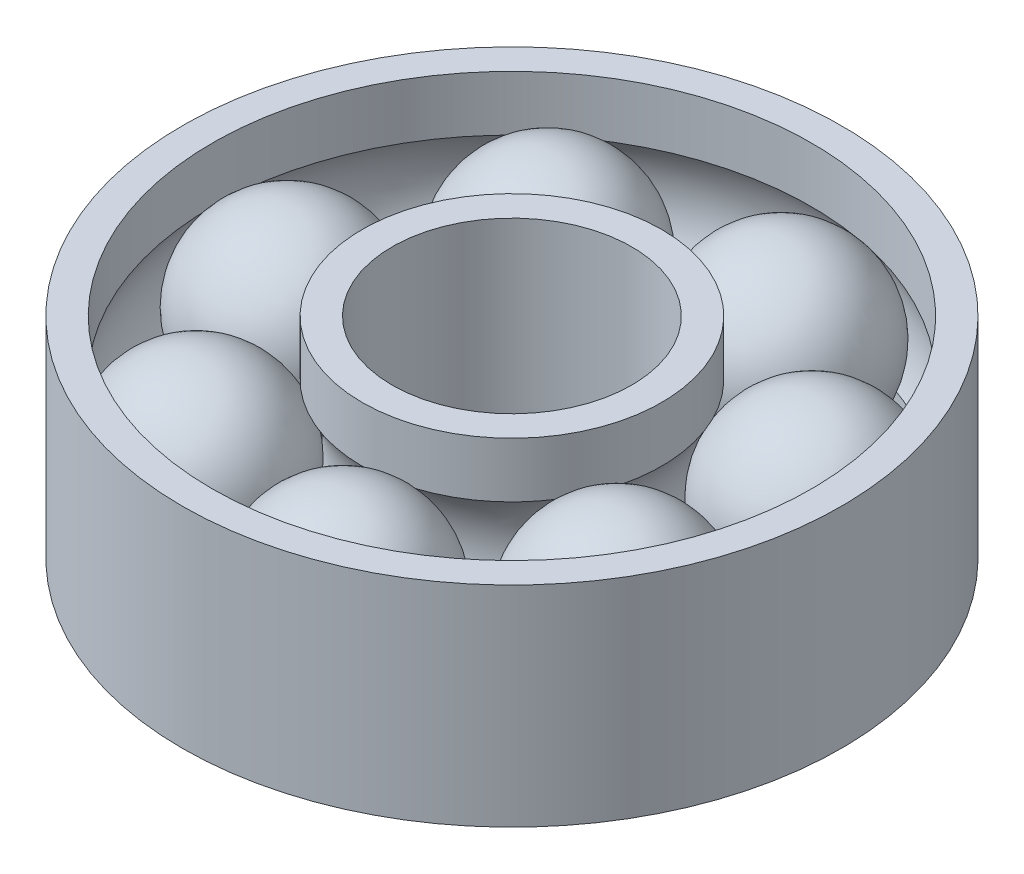
ISO-10303-21;
HEADER;
FILE_DESCRIPTION(('STEP AP214'),'2;1');
FILE_NAME('part.step','',(''),(''),'','','');
FILE_SCHEMA(('AUTOMOTIVE_DESIGN { 1 0 10303 214 1 1 1 1 }'));
ENDSEC;
DATA;
#1=APPLICATION_CONTEXT('core data for automotive mechanical design processes');
#2=APPLICATION_PROTOCOL_DEFINITION('international standard','automotive_design',2000,#1);
#3=PRODUCT_CONTEXT('',#1,'mechanical');
#4=PRODUCT('Part','Part','',(#3));
#5=PRODUCT_RELATED_PRODUCT_CATEGORY('part','',(#4));
#6=PRODUCT_DEFINITION_FORMATION('','',#4);
#7=PRODUCT_DEFINITION_CONTEXT('part definition',#1,'design');
#8=PRODUCT_DEFINITION('design','',#6,#7);
#9=PRODUCT_DEFINITION_SHAPE('','',#8);
#10=(LENGTH_UNIT() NAMED_UNIT(*) SI_UNIT(.MILLI.,.METRE.));
#11=(NAMED_UNIT(*) PLANE_ANGLE_UNIT() SI_UNIT($,.RADIAN.));
#12=(NAMED_UNIT(*) SI_UNIT($,.STERADIAN.) SOLID_ANGLE_UNIT());
#13=UNCERTAINTY_MEASURE_WITH_UNIT(LENGTH_MEASURE(1.E-05),#10,'distance_accuracy_value','');
#14=(GEOMETRIC_REPRESENTATION_CONTEXT(3) GLOBAL_UNCERTAINTY_ASSIGNED_CONTEXT((#13)) GLOBAL_UNIT_ASSIGNED_CONTEXT((#10,
#11,#12)) REPRESENTATION_CONTEXT('',''));
#15=CARTESIAN_POINT('',(0.,0.,0.));
#16=DIRECTION('',(0.,0.,1.));
#17=DIRECTION('',(1.,0.,0.));
#18=AXIS2_PLACEMENT_3D('',#15,#16,#17);
#19=CARTESIAN_POINT('',(-4.67617351394057,1.04291762280334,-5.86373611851017));
#20=DIRECTION('',(0.,1.,0.));
#21=DIRECTION('',(-0.623489801858743,0.,-0.781831482468022));
#22=AXIS2_PLACEMENT_3D('',#19,#20,#21);
#23=SPHERICAL_SURFACE('',#22,3.);
#24=CARTESIAN_POINT('',(-4.67617351394057,4.04291762280334,-5.86373611851016));
#25=VERTEX_POINT('',#24);
#26=VERTEX_LOOP('',#25);
#27=FACE_BOUND('',#26,.T.);
#28=ADVANCED_FACE('F37',(#27),#23,.T.);
#29=CLOSED_SHELL('',(#28));
#30=MANIFOLD_SOLID_BREP('B2',#29);
#31=CARTESIAN_POINT('',(1.66890700467229,1.04291762280334,-7.31195934136369));
#32=DIRECTION('',(0.,1.,0.));
#33=DIRECTION('',(0.222520933956305,0.,-0.974927912181826));
#34=AXIS2_PLACEMENT_3D('',#31,#32,#33);
#35=SPHERICAL_SURFACE('',#34,3.);
#36=CARTESIAN_POINT('',(1.66890700467229,4.04291762280334,-7.31195934136368));
#37=VERTEX_POINT('',#36);
#38=VERTEX_LOOP('',#37);
#39=FACE_BOUND('',#38,.T.);
#40=ADVANCED_FACE('F55',(#39),#35,.T.);
#41=CLOSED_SHELL('',(#40));
#42=MANIFOLD_SOLID_BREP('B6',#41);
#43=CARTESIAN_POINT('',(6.75726650926812,1.04291762280334,-3.25412804338174));
#44=DIRECTION('',(0.,1.,0.));
#45=DIRECTION('',(0.900968867902416,0.,-0.433883739117565));
#46=AXIS2_PLACEMENT_3D('',#43,#44,#45);
#47=SPHERICAL_SURFACE('',#46,3.);
#48=CARTESIAN_POINT('',(6.75726650926811,4.04291762280334,-3.25412804338173));
#49=VERTEX_POINT('',#48);
#50=VERTEX_LOOP('',#49);
#51=FACE_BOUND('',#50,.T.);
#52=ADVANCED_FACE('F73',(#51),#47,.T.);
#53=CLOSED_SHELL('',(#52));
#54=MANIFOLD_SOLID_BREP('B33',#53);
#55=CARTESIAN_POINT('',(6.75726650926816,1.04291762280334,3.25412804338164));
#56=DIRECTION('',(0.,1.,0.));
#57=DIRECTION('',(0.900968867902422,0.,0.433883739117553));
#58=AXIS2_PLACEMENT_3D('',#55,#56,#57);
#59=SPHERICAL_SURFACE('',#58,3.);
#60=CARTESIAN_POINT('',(6.75726650926816,4.04291762280334,3.25412804338164));
#61=VERTEX_POINT('',#60);
#62=VERTEX_LOOP('',#61);
#63=FACE_BOUND('',#62,.T.);
#64=ADVANCED_FACE('F91',(#63),#59,.T.);
#65=CLOSED_SHELL('',(#64));
#66=MANIFOLD_SOLID_BREP('B51',#65);
#67=CARTESIAN_POINT('',(1.66890700467239,1.04291762280334,7.31195934136367));
#68=DIRECTION('',(0.,1.,0.));
#69=DIRECTION('',(0.222520933956318,0.,0.974927912181823));
#70=AXIS2_PLACEMENT_3D('',#67,#68,#69);
#71=SPHERICAL_SURFACE('',#70,3.);
#72=CARTESIAN_POINT('',(1.66890700467238,4.04291762280334,7.31195934136366));
#73=VERTEX_POINT('',#72);
#74=VERTEX_LOOP('',#73);
#75=FACE_BOUND('',#74,.T.);
#76=ADVANCED_FACE('F109',(#75),#71,.T.);
#77=CLOSED_SHELL('',(#76));
#78=MANIFOLD_SOLID_BREP('B69',#77);
#79=CARTESIAN_POINT('',(-4.67617351394049,1.04291762280334,5.86373611851023));
#80=DIRECTION('',(0.,1.,0.));
#81=DIRECTION('',(-0.623489801858732,0.,0.781831482468031));
#82=AXIS2_PLACEMENT_3D('',#79,#80,#81);
#83=SPHERICAL_SURFACE('',#82,3.);
#84=CARTESIAN_POINT('',(-4.67617351394048,4.04291762280334,5.86373611851023));
#85=VERTEX_POINT('',#84);
#86=VERTEX_LOOP('',#85);
#87=FACE_BOUND('',#86,.T.);
#88=ADVANCED_FACE('F129',(#87),#83,.T.);
#89=CLOSED_SHELL('',(#88));
#90=MANIFOLD_SOLID_BREP('B87',#89);
#91=CARTESIAN_POINT('',(0.,50.,0.));
#92=DIRECTION('',(0.,1.,0.));
#93=DIRECTION('',(0.,0.,1.));
#94=AXIS2_PLACEMENT_3D('',#91,#92,#93);
#95=CYLINDRICAL_SURFACE('',#94,11.);
#96=CARTESIAN_POINT('',(0.,-2.45708237719666,0.));
#97=DIRECTION('',(0.,1.,0.));
#98=DIRECTION('',(0.,0.,1.));
#99=AXIS2_PLACEMENT_3D('',#96,#97,#98);
#100=CIRCLE('',#99,11.);
#101=CARTESIAN_POINT('',(0.,-2.45708237719666,11.));
#102=VERTEX_POINT('',#101);
#103=EDGE_CURVE('E128',#102,#102,#100,.T.);
#104=ORIENTED_EDGE('',*,*,#103,.T.);
#105=EDGE_LOOP('',(#104));
#106=FACE_BOUND('',#105,.T.);
#107=CARTESIAN_POINT('',(0.,4.54291762280334,0.));
#108=DIRECTION('',(0.,1.,0.));
#109=DIRECTION('',(0.,0.,1.));
#110=AXIS2_PLACEMENT_3D('',#107,#108,#109);
#111=CIRCLE('',#110,11.);
#112=CARTESIAN_POINT('',(0.,4.54291762280334,11.));
#113=VERTEX_POINT('',#112);
#114=EDGE_CURVE('E171',#113,#113,#111,.T.);
#115=ORIENTED_EDGE('',*,*,#114,.F.);
#116=EDGE_LOOP('',(#115));
#117=FACE_BOUND('',#116,.T.);
#118=ADVANCED_FACE('F149',(#106,#117),#95,.T.);
#119=CARTESIAN_POINT('',(-10.,-2.45708237719666,0.));
#120=DIRECTION('',(0.,-1.,0.));
#121=DIRECTION('',(0.,0.,-1.));
#122=AXIS2_PLACEMENT_3D('',#119,#120,#121);
#123=PLANE('',#122);
#124=CARTESIAN_POINT('',(0.,-2.45708237719666,0.));
#125=DIRECTION('',(0.,1.,0.));
#126=DIRECTION('',(0.,0.,1.));
#127=AXIS2_PLACEMENT_3D('',#124,#125,#126);
#128=CIRCLE('',#127,10.);
#129=CARTESIAN_POINT('',(0.,-2.45708237719666,10.));
#130=VERTEX_POINT('',#129);
#131=EDGE_CURVE('E155',#130,#130,#128,.T.);
#132=ORIENTED_EDGE('',*,*,#131,.T.);
#133=EDGE_LOOP('',(#132));
#134=FACE_BOUND('',#133,.T.);
#135=ORIENTED_EDGE('',*,*,#103,.F.);
#136=EDGE_LOOP('',(#135));
#137=FACE_BOUND('',#136,.T.);
#138=ADVANCED_FACE('F179',(#134,#137),#123,.T.);
#139=CARTESIAN_POINT('',(0.,50.,0.));
#140=DIRECTION('',(0.,1.,0.));
#141=DIRECTION('',(0.,0.,1.));
#142=AXIS2_PLACEMENT_3D('',#139,#140,#141);
#143=CYLINDRICAL_SURFACE('',#142,10.);
#144=CARTESIAN_POINT('',(0.,-0.615394772374357,0.));
#145=DIRECTION('',(0.,1.,0.));
#146=DIRECTION('',(0.,0.,1.));
#147=AXIS2_PLACEMENT_3D('',#144,#145,#146);
#148=CIRCLE('',#147,10.);
#149=CARTESIAN_POINT('',(0.,-0.615394772374357,10.));
#150=VERTEX_POINT('',#149);
#151=EDGE_CURVE('E159',#150,#150,#148,.T.);
#152=ORIENTED_EDGE('',*,*,#151,.T.);
#153=EDGE_LOOP('',(#152));
#154=FACE_BOUND('',#153,.T.);
#155=ORIENTED_EDGE('',*,*,#131,.F.);
#156=EDGE_LOOP('',(#155));
#157=FACE_BOUND('',#156,.T.);
#158=ADVANCED_FACE('F183',(#154,#157),#143,.F.);
#159=CARTESIAN_POINT('',(0.,1.04291762280334,0.));
#160=DIRECTION('',(0.,1.,0.));
#161=DIRECTION('',(0.,0.,1.));
#162=AXIS2_PLACEMENT_3D('',#159,#160,#161);
#163=TOROIDAL_SURFACE('',#162,7.5,3.);
#164=CARTESIAN_POINT('',(0.,2.70123001798105,0.));
#165=DIRECTION('',(0.,1.,0.));
#166=DIRECTION('',(0.,0.,1.));
#167=AXIS2_PLACEMENT_3D('',#164,#165,#166);
#168=CIRCLE('',#167,10.);
#169=CARTESIAN_POINT('',(0.,2.70123001798105,10.));
#170=VERTEX_POINT('',#169);
#171=EDGE_CURVE('E163',#170,#170,#168,.T.);
#172=ORIENTED_EDGE('',*,*,#171,.T.);
#173=EDGE_LOOP('',(#172));
#174=FACE_BOUND('',#173,.T.);
#175=ORIENTED_EDGE('',*,*,#151,.F.);
#176=EDGE_LOOP('',(#175));
#177=FACE_BOUND('',#176,.T.);
#178=ADVANCED_FACE('F187',(#174,#177),#163,.F.);
#179=CARTESIAN_POINT('',(0.,50.,0.));
#180=DIRECTION('',(0.,1.,0.));
#181=DIRECTION('',(0.,0.,1.));
#182=AXIS2_PLACEMENT_3D('',#179,#180,#181);
#183=CYLINDRICAL_SURFACE('',#182,10.);
#184=CARTESIAN_POINT('',(0.,4.54291762280334,0.));
#185=DIRECTION('',(0.,1.,0.));
#186=DIRECTION('',(0.,0.,1.));
#187=AXIS2_PLACEMENT_3D('',#184,#185,#186);
#188=CIRCLE('',#187,10.);
#189=CARTESIAN_POINT('',(0.,4.54291762280334,10.));
#190=VERTEX_POINT('',#189);
#191=EDGE_CURVE('E168',#190,#190,#188,.T.);
#192=ORIENTED_EDGE('',*,*,#191,.T.);
#193=EDGE_LOOP('',(#192));
#194=FACE_BOUND('',#193,.T.);
#195=ORIENTED_EDGE('',*,*,#171,.F.);
#196=EDGE_LOOP('',(#195));
#197=FACE_BOUND('',#196,.T.);
#198=ADVANCED_FACE('F194',(#194,#197),#183,.F.);
#199=CARTESIAN_POINT('',(-10.,4.54291762280334,0.));
#200=DIRECTION('',(0.,1.,0.));
#201=DIRECTION('',(0.,0.,1.));
#202=AXIS2_PLACEMENT_3D('',#199,#200,#201);
#203=PLANE('',#202);
#204=ORIENTED_EDGE('',*,*,#114,.T.);
#205=EDGE_LOOP('',(#204));
#206=FACE_BOUND('',#205,.T.);
#207=ORIENTED_EDGE('',*,*,#191,.F.);
#208=EDGE_LOOP('',(#207));
#209=FACE_BOUND('',#208,.T.);
#210=ADVANCED_FACE('F175',(#206,#209),#203,.T.);
#211=CLOSED_SHELL('',(#118,#138,#158,#178,#198,#210));
#212=MANIFOLD_SOLID_BREP('B105',#211);
#213=CARTESIAN_POINT('',(0.,50.,0.));
#214=DIRECTION('',(0.,1.,0.));
#215=DIRECTION('',(0.,0.,1.));
#216=AXIS2_PLACEMENT_3D('',#213,#214,#215);
#217=CYLINDRICAL_SURFACE('',#216,5.);
#218=CARTESIAN_POINT('',(0.,-2.45708237719666,0.));
#219=DIRECTION('',(0.,1.,0.));
#220=DIRECTION('',(0.,0.,1.));
#221=AXIS2_PLACEMENT_3D('',#218,#219,#220);
#222=CIRCLE('',#221,5.);
#223=CARTESIAN_POINT('',(0.,-2.45708237719666,5.));
#224=VERTEX_POINT('',#223);
#225=EDGE_CURVE('E148',#224,#224,#222,.T.);
#226=ORIENTED_EDGE('',*,*,#225,.T.);
#227=EDGE_LOOP('',(#226));
#228=FACE_BOUND('',#227,.T.);
#229=CARTESIAN_POINT('',(0.,-0.615394772374357,0.));
#230=DIRECTION('',(0.,1.,0.));
#231=DIRECTION('',(0.,0.,1.));
#232=AXIS2_PLACEMENT_3D('',#229,#230,#231);
#233=CIRCLE('',#232,5.);
#234=CARTESIAN_POINT('',(0.,-0.615394772374357,5.));
#235=VERTEX_POINT('',#234);
#236=EDGE_CURVE('E267',#235,#235,#233,.T.);
#237=ORIENTED_EDGE('',*,*,#236,.F.);
#238=EDGE_LOOP('',(#237));
#239=FACE_BOUND('',#238,.T.);
#240=ADVANCED_FACE('F245',(#228,#239),#217,.T.);
#241=CARTESIAN_POINT('',(-4.,-2.45708237719666,0.));
#242=DIRECTION('',(0.,-1.,0.));
#243=DIRECTION('',(0.,0.,-1.));
#244=AXIS2_PLACEMENT_3D('',#241,#242,#243);
#245=PLANE('',#244);
#246=CARTESIAN_POINT('',(0.,-2.45708237719666,0.));
#247=DIRECTION('',(0.,1.,0.));
#248=DIRECTION('',(0.,0.,1.));
#249=AXIS2_PLACEMENT_3D('',#246,#247,#248);
#250=CIRCLE('',#249,4.);
#251=CARTESIAN_POINT('',(0.,-2.45708237719666,4.));
#252=VERTEX_POINT('',#251);
#253=EDGE_CURVE('E251',#252,#252,#250,.T.);
#254=ORIENTED_EDGE('',*,*,#253,.T.);
#255=EDGE_LOOP('',(#254));
#256=FACE_BOUND('',#255,.T.);
#257=ORIENTED_EDGE('',*,*,#225,.F.);
#258=EDGE_LOOP('',(#257));
#259=FACE_BOUND('',#258,.T.);
#260=ADVANCED_FACE('F275',(#256,#259),#245,.T.);
#261=CARTESIAN_POINT('',(0.,50.,0.));
#262=DIRECTION('',(0.,1.,0.));
#263=DIRECTION('',(0.,0.,1.));
#264=AXIS2_PLACEMENT_3D('',#261,#262,#263);
#265=CYLINDRICAL_SURFACE('',#264,4.);
#266=CARTESIAN_POINT('',(0.,4.54291762280334,0.));
#267=DIRECTION('',(0.,1.,0.));
#268=DIRECTION('',(0.,0.,1.));
#269=AXIS2_PLACEMENT_3D('',#266,#267,#268);
#270=CIRCLE('',#269,4.);
#271=CARTESIAN_POINT('',(0.,4.54291762280334,4.));
#272=VERTEX_POINT('',#271);
#273=EDGE_CURVE('E255',#272,#272,#270,.T.);
#274=ORIENTED_EDGE('',*,*,#273,.T.);
#275=EDGE_LOOP('',(#274));
#276=FACE_BOUND('',#275,.T.);
#277=ORIENTED_EDGE('',*,*,#253,.F.);
#278=EDGE_LOOP('',(#277));
#279=FACE_BOUND('',#278,.T.);
#280=ADVANCED_FACE('F279',(#276,#279),#265,.F.);
#281=CARTESIAN_POINT('',(-4.,4.54291762280334,0.));
#282=DIRECTION('',(0.,1.,0.));
#283=DIRECTION('',(0.,0.,1.));
#284=AXIS2_PLACEMENT_3D('',#281,#282,#283);
#285=PLANE('',#284);
#286=CARTESIAN_POINT('',(0.,4.54291762280334,0.));
#287=DIRECTION('',(0.,1.,0.));
#288=DIRECTION('',(0.,0.,1.));
#289=AXIS2_PLACEMENT_3D('',#286,#287,#288);
#290=CIRCLE('',#289,5.);
#291=CARTESIAN_POINT('',(0.,4.54291762280334,5.));
#292=VERTEX_POINT('',#291);
#293=EDGE_CURVE('E259',#292,#292,#290,.T.);
#294=ORIENTED_EDGE('',*,*,#293,.T.);
#295=EDGE_LOOP('',(#294));
#296=FACE_BOUND('',#295,.T.);
#297=ORIENTED_EDGE('',*,*,#273,.F.);
#298=EDGE_LOOP('',(#297));
#299=FACE_BOUND('',#298,.T.);
#300=ADVANCED_FACE('F283',(#296,#299),#285,.T.);
#301=CARTESIAN_POINT('',(0.,50.,0.));
#302=DIRECTION('',(0.,1.,0.));
#303=DIRECTION('',(0.,0.,1.));
#304=AXIS2_PLACEMENT_3D('',#301,#302,#303);
#305=CYLINDRICAL_SURFACE('',#304,5.);
#306=CARTESIAN_POINT('',(0.,2.70123001798105,0.));
#307=DIRECTION('',(0.,1.,0.));
#308=DIRECTION('',(0.,0.,1.));
#309=AXIS2_PLACEMENT_3D('',#306,#307,#308);
#310=CIRCLE('',#309,5.);
#311=CARTESIAN_POINT('',(0.,2.70123001798105,5.));
#312=VERTEX_POINT('',#311);
#313=EDGE_CURVE('E264',#312,#312,#310,.T.);
#314=ORIENTED_EDGE('',*,*,#313,.T.);
#315=EDGE_LOOP('',(#314));
#316=FACE_BOUND('',#315,.T.);
#317=ORIENTED_EDGE('',*,*,#293,.F.);
#318=EDGE_LOOP('',(#317));
#319=FACE_BOUND('',#318,.T.);
#320=ADVANCED_FACE('F290',(#316,#319),#305,.T.);
#321=CARTESIAN_POINT('',(0.,1.04291762280334,0.));
#322=DIRECTION('',(0.,1.,0.));
#323=DIRECTION('',(0.,0.,1.));
#324=AXIS2_PLACEMENT_3D('',#321,#322,#323);
#325=TOROIDAL_SURFACE('',#324,7.5,3.);
#326=ORIENTED_EDGE('',*,*,#236,.T.);
#327=EDGE_LOOP('',(#326));
#328=FACE_BOUND('',#327,.T.);
#329=ORIENTED_EDGE('',*,*,#313,.F.);
#330=EDGE_LOOP('',(#329));
#331=FACE_BOUND('',#330,.T.);
#332=ADVANCED_FACE('F271',(#328,#331),#325,.F.);
#333=CLOSED_SHELL('',(#240,#260,#280,#300,#320,#332));
#334=MANIFOLD_SOLID_BREP('B123',#333);
#335=CARTESIAN_POINT('',(-7.5,1.04291762280334,0.));
#336=DIRECTION('',(0.,1.,0.));
#337=DIRECTION('',(-1.,0.,0.));
#338=AXIS2_PLACEMENT_3D('',#335,#336,#337);
#339=SPHERICAL_SURFACE('',#338,3.);
#340=CARTESIAN_POINT('',(-7.49999999999999,4.04291762280334,0.));
#341=VERTEX_POINT('',#340);
#342=VERTEX_LOOP('',#341);
#343=FACE_BOUND('',#342,.T.);
#344=ADVANCED_FACE('F336',(#343),#339,.T.);
#345=CLOSED_SHELL('',(#344));
#346=MANIFOLD_SOLID_BREP('B143',#345);
#347=ADVANCED_BREP_SHAPE_REPRESENTATION('',(#18,#30,#42,#54,#66,#78,#90,#212,#334,#346),#14);
#348=SHAPE_DEFINITION_REPRESENTATION(#9,#347);
ENDSEC;
END-ISO-10303-21;
